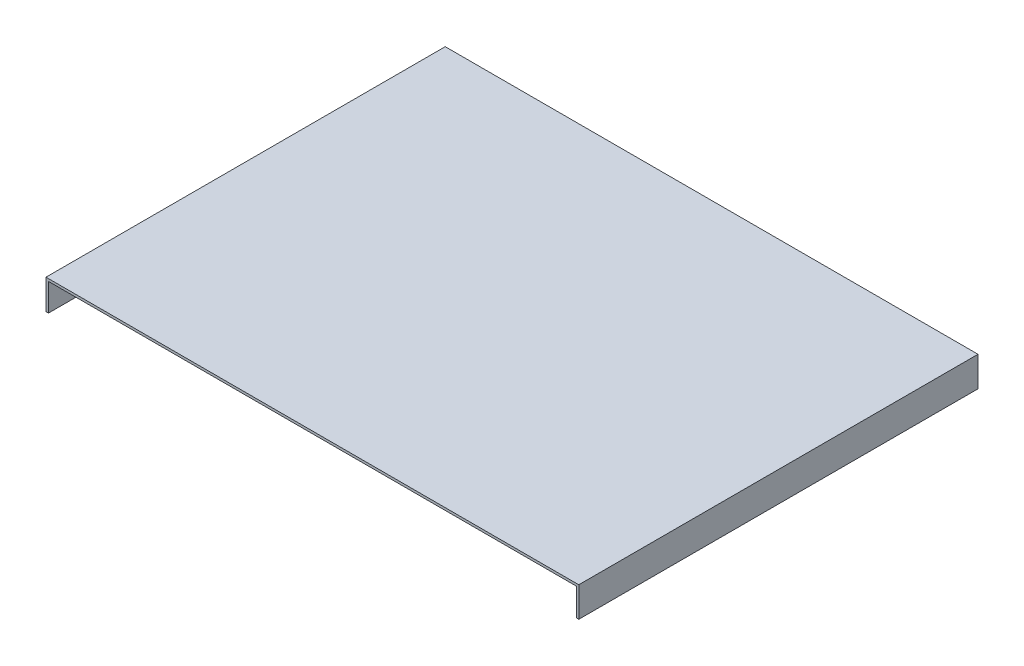
ISO-10303-21;
HEADER;
FILE_DESCRIPTION(('STEP AP214'),'2;1');
FILE_NAME('part.step','',(''),(''),'','','');
FILE_SCHEMA(('AUTOMOTIVE_DESIGN { 1 0 10303 214 1 1 1 1 }'));
ENDSEC;
DATA;
#1=APPLICATION_CONTEXT('core data for automotive mechanical design processes');
#2=APPLICATION_PROTOCOL_DEFINITION('international standard','automotive_design',2000,#1);
#3=PRODUCT_CONTEXT('',#1,'mechanical');
#4=PRODUCT('Part','Part','',(#3));
#5=PRODUCT_RELATED_PRODUCT_CATEGORY('part','',(#4));
#6=PRODUCT_DEFINITION_FORMATION('','',#4);
#7=PRODUCT_DEFINITION_CONTEXT('part definition',#1,'design');
#8=PRODUCT_DEFINITION('design','',#6,#7);
#9=PRODUCT_DEFINITION_SHAPE('','',#8);
#10=(LENGTH_UNIT() NAMED_UNIT(*) SI_UNIT(.MILLI.,.METRE.));
#11=(NAMED_UNIT(*) PLANE_ANGLE_UNIT() SI_UNIT($,.RADIAN.));
#12=(NAMED_UNIT(*) SI_UNIT($,.STERADIAN.) SOLID_ANGLE_UNIT());
#13=UNCERTAINTY_MEASURE_WITH_UNIT(LENGTH_MEASURE(1.E-05),#10,'distance_accuracy_value','');
#14=(GEOMETRIC_REPRESENTATION_CONTEXT(3) GLOBAL_UNCERTAINTY_ASSIGNED_CONTEXT((#13)) GLOBAL_UNIT_ASSIGNED_CONTEXT((#10,
#11,#12)) REPRESENTATION_CONTEXT('',''));
#15=CARTESIAN_POINT('',(0.,0.,0.));
#16=DIRECTION('',(0.,0.,1.));
#17=DIRECTION('',(1.,0.,0.));
#18=AXIS2_PLACEMENT_3D('',#15,#16,#17);
#19=CARTESIAN_POINT('',(-193.5,-1.75,290.));
#20=DIRECTION('',(0.,1.,0.));
#21=DIRECTION('',(-1.,0.,0.));
#22=AXIS2_PLACEMENT_3D('',#19,#20,#21);
#23=PLANE('',#22);
#24=DIRECTION('',(0.,0.,1.));
#25=VECTOR('',#24,1.);
#26=CARTESIAN_POINT('',(-191.75,-1.75,1.74999999999995));
#27=LINE('',#26,#25);
#28=CARTESIAN_POINT('',(-191.75,-1.75,1.74999999999995));
#29=VERTEX_POINT('',#28);
#30=CARTESIAN_POINT('',(-191.75,-1.75,290.));
#31=VERTEX_POINT('',#30);
#32=EDGE_CURVE('E49',#29,#31,#27,.T.);
#33=ORIENTED_EDGE('',*,*,#32,.F.);
#34=DIRECTION('',(-1.,0.,0.));
#35=VECTOR('',#34,1.);
#36=CARTESIAN_POINT('',(191.75,-1.75,1.75));
#37=LINE('',#36,#35);
#38=CARTESIAN_POINT('',(191.75,-1.75,1.75));
#39=VERTEX_POINT('',#38);
#40=EDGE_CURVE('E126',#39,#29,#37,.T.);
#41=ORIENTED_EDGE('',*,*,#40,.F.);
#42=DIRECTION('',(0.,0.,-1.));
#43=VECTOR('',#42,1.);
#44=CARTESIAN_POINT('',(191.75,-1.75,290.));
#45=LINE('',#44,#43);
#46=CARTESIAN_POINT('',(191.75,-1.75,290.));
#47=VERTEX_POINT('',#46);
#48=EDGE_CURVE('E54',#47,#39,#45,.T.);
#49=ORIENTED_EDGE('',*,*,#48,.F.);
#50=DIRECTION('',(1.,0.,0.));
#51=VECTOR('',#50,1.);
#52=CARTESIAN_POINT('',(-193.5,-1.75,290.));
#53=LINE('',#52,#51);
#54=EDGE_CURVE('E109',#31,#47,#53,.T.);
#55=ORIENTED_EDGE('',*,*,#54,.F.);
#56=EDGE_LOOP('',(#33,#41,#49,#55));
#57=FACE_BOUND('',#56,.T.);
#58=ADVANCED_FACE('F34',(#57),#23,.F.);
#59=CARTESIAN_POINT('',(193.5,0.,290.));
#60=DIRECTION('',(-1.,0.,0.));
#61=DIRECTION('',(0.,0.,1.));
#62=AXIS2_PLACEMENT_3D('',#59,#60,#61);
#63=PLANE('',#62);
#64=DIRECTION('',(0.,1.,0.));
#65=VECTOR('',#64,1.);
#66=CARTESIAN_POINT('',(193.5,0.,0.));
#67=LINE('',#66,#65);
#68=CARTESIAN_POINT('',(193.5,-21.75,0.));
#69=VERTEX_POINT('',#68);
#70=CARTESIAN_POINT('',(193.5,0.,0.));
#71=VERTEX_POINT('',#70);
#72=EDGE_CURVE('E153',#69,#71,#67,.T.);
#73=ORIENTED_EDGE('',*,*,#72,.T.);
#74=DIRECTION('',(0.,0.,-1.));
#75=VECTOR('',#74,1.);
#76=CARTESIAN_POINT('',(193.5,0.,290.));
#77=LINE('',#76,#75);
#78=CARTESIAN_POINT('',(193.5,0.,290.));
#79=VERTEX_POINT('',#78);
#80=EDGE_CURVE('E11',#79,#71,#77,.T.);
#81=ORIENTED_EDGE('',*,*,#80,.F.);
#82=DIRECTION('',(0.,1.,0.));
#83=VECTOR('',#82,1.);
#84=CARTESIAN_POINT('',(193.5,0.,290.));
#85=LINE('',#84,#83);
#86=CARTESIAN_POINT('',(193.5,-21.75,290.));
#87=VERTEX_POINT('',#86);
#88=EDGE_CURVE('E154',#87,#79,#85,.T.);
#89=ORIENTED_EDGE('',*,*,#88,.F.);
#90=DIRECTION('',(0.,0.,1.));
#91=VECTOR('',#90,1.);
#92=CARTESIAN_POINT('',(193.5,-21.75,0.));
#93=LINE('',#92,#91);
#94=EDGE_CURVE('E130',#69,#87,#93,.T.);
#95=ORIENTED_EDGE('',*,*,#94,.F.);
#96=EDGE_LOOP('',(#73,#81,#89,#95));
#97=FACE_BOUND('',#96,.T.);
#98=ADVANCED_FACE('F36',(#97),#63,.F.);
#99=CARTESIAN_POINT('',(-193.5,0.,290.));
#100=DIRECTION('',(0.,-1.,0.));
#101=DIRECTION('',(1.,0.,0.));
#102=AXIS2_PLACEMENT_3D('',#99,#100,#101);
#103=PLANE('',#102);
#104=DIRECTION('',(-1.,0.,0.));
#105=VECTOR('',#104,1.);
#106=CARTESIAN_POINT('',(-193.5,0.,0.));
#107=LINE('',#106,#105);
#108=CARTESIAN_POINT('',(-193.5,0.,0.));
#109=VERTEX_POINT('',#108);
#110=EDGE_CURVE('E160',#71,#109,#107,.T.);
#111=ORIENTED_EDGE('',*,*,#110,.T.);
#112=DIRECTION('',(0.,0.,-1.));
#113=VECTOR('',#112,1.);
#114=CARTESIAN_POINT('',(-193.5,0.,290.));
#115=LINE('',#114,#113);
#116=CARTESIAN_POINT('',(-193.5,0.,290.));
#117=VERTEX_POINT('',#116);
#118=EDGE_CURVE('E42',#117,#109,#115,.T.);
#119=ORIENTED_EDGE('',*,*,#118,.F.);
#120=DIRECTION('',(-1.,0.,0.));
#121=VECTOR('',#120,1.);
#122=CARTESIAN_POINT('',(-193.5,0.,290.));
#123=LINE('',#122,#121);
#124=EDGE_CURVE('E105',#79,#117,#123,.T.);
#125=ORIENTED_EDGE('',*,*,#124,.F.);
#126=ORIENTED_EDGE('',*,*,#80,.T.);
#127=EDGE_LOOP('',(#111,#119,#125,#126));
#128=FACE_BOUND('',#127,.T.);
#129=ADVANCED_FACE('F185',(#128),#103,.F.);
#130=CARTESIAN_POINT('',(-193.5,0.,290.));
#131=DIRECTION('',(1.,0.,0.));
#132=DIRECTION('',(0.,0.,-1.));
#133=AXIS2_PLACEMENT_3D('',#130,#131,#132);
#134=PLANE('',#133);
#135=DIRECTION('',(0.,-1.,0.));
#136=VECTOR('',#135,1.);
#137=CARTESIAN_POINT('',(-193.5,0.,0.));
#138=LINE('',#137,#136);
#139=CARTESIAN_POINT('',(-193.5,-21.75,0.));
#140=VERTEX_POINT('',#139);
#141=EDGE_CURVE('E115',#109,#140,#138,.T.);
#142=ORIENTED_EDGE('',*,*,#141,.T.);
#143=DIRECTION('',(0.,0.,-1.));
#144=VECTOR('',#143,1.);
#145=CARTESIAN_POINT('',(-193.5,-21.75,290.));
#146=LINE('',#145,#144);
#147=CARTESIAN_POINT('',(-193.5,-21.75,290.));
#148=VERTEX_POINT('',#147);
#149=EDGE_CURVE('E112',#148,#140,#146,.T.);
#150=ORIENTED_EDGE('',*,*,#149,.F.);
#151=DIRECTION('',(0.,-1.,0.));
#152=VECTOR('',#151,1.);
#153=CARTESIAN_POINT('',(-193.5,0.,290.));
#154=LINE('',#153,#152);
#155=EDGE_CURVE('E98',#117,#148,#154,.T.);
#156=ORIENTED_EDGE('',*,*,#155,.F.);
#157=ORIENTED_EDGE('',*,*,#118,.T.);
#158=EDGE_LOOP('',(#142,#150,#156,#157));
#159=FACE_BOUND('',#158,.T.);
#160=ADVANCED_FACE('F113',(#159),#134,.F.);
#161=CARTESIAN_POINT('',(0.,0.,290.));
#162=DIRECTION('',(0.,0.,1.));
#163=DIRECTION('',(1.,0.,0.));
#164=AXIS2_PLACEMENT_3D('',#161,#162,#163);
#165=PLANE('',#164);
#166=ORIENTED_EDGE('',*,*,#88,.T.);
#167=ORIENTED_EDGE('',*,*,#124,.T.);
#168=ORIENTED_EDGE('',*,*,#155,.T.);
#169=DIRECTION('',(-1.,0.,0.));
#170=VECTOR('',#169,1.);
#171=CARTESIAN_POINT('',(-191.75,-21.75,290.));
#172=LINE('',#171,#170);
#173=CARTESIAN_POINT('',(-191.75,-21.75,290.));
#174=VERTEX_POINT('',#173);
#175=EDGE_CURVE('E104',#174,#148,#172,.T.);
#176=ORIENTED_EDGE('',*,*,#175,.F.);
#177=DIRECTION('',(0.,1.,0.));
#178=VECTOR('',#177,1.);
#179=CARTESIAN_POINT('',(-191.75,-21.75,290.));
#180=LINE('',#179,#178);
#181=EDGE_CURVE('E140',#174,#31,#180,.T.);
#182=ORIENTED_EDGE('',*,*,#181,.T.);
#183=ORIENTED_EDGE('',*,*,#54,.T.);
#184=DIRECTION('',(0.,1.,0.));
#185=VECTOR('',#184,1.);
#186=CARTESIAN_POINT('',(191.75,-21.75,290.));
#187=LINE('',#186,#185);
#188=CARTESIAN_POINT('',(191.75,-21.75,290.));
#189=VERTEX_POINT('',#188);
#190=EDGE_CURVE('E150',#189,#47,#187,.T.);
#191=ORIENTED_EDGE('',*,*,#190,.F.);
#192=DIRECTION('',(-1.,0.,0.));
#193=VECTOR('',#192,1.);
#194=CARTESIAN_POINT('',(193.5,-21.75,290.));
#195=LINE('',#194,#193);
#196=EDGE_CURVE('E133',#87,#189,#195,.T.);
#197=ORIENTED_EDGE('',*,*,#196,.F.);
#198=EDGE_LOOP('',(#166,#167,#168,#176,#182,#183,#191,#197));
#199=FACE_BOUND('',#198,.T.);
#200=ADVANCED_FACE('F101',(#199),#165,.T.);
#201=CARTESIAN_POINT('',(0.,0.,0.));
#202=DIRECTION('',(0.,0.,1.));
#203=DIRECTION('',(1.,0.,0.));
#204=AXIS2_PLACEMENT_3D('',#201,#202,#203);
#205=PLANE('',#204);
#206=ORIENTED_EDGE('',*,*,#72,.F.);
#207=DIRECTION('',(1.,0.,0.));
#208=VECTOR('',#207,1.);
#209=CARTESIAN_POINT('',(-193.5,-21.75,0.));
#210=LINE('',#209,#208);
#211=EDGE_CURVE('E119',#140,#69,#210,.T.);
#212=ORIENTED_EDGE('',*,*,#211,.F.);
#213=ORIENTED_EDGE('',*,*,#141,.F.);
#214=ORIENTED_EDGE('',*,*,#110,.F.);
#215=EDGE_LOOP('',(#206,#212,#213,#214));
#216=FACE_BOUND('',#215,.T.);
#217=ADVANCED_FACE('F164',(#216),#205,.F.);
#218=CARTESIAN_POINT('',(191.75,-21.75,290.));
#219=DIRECTION('',(1.,0.,0.));
#220=DIRECTION('',(0.,0.,-1.));
#221=AXIS2_PLACEMENT_3D('',#218,#219,#220);
#222=PLANE('',#221);
#223=ORIENTED_EDGE('',*,*,#48,.T.);
#224=DIRECTION('',(0.,1.,0.));
#225=VECTOR('',#224,1.);
#226=CARTESIAN_POINT('',(191.75,-21.75,1.75));
#227=LINE('',#226,#225);
#228=CARTESIAN_POINT('',(191.75,-21.75,1.75));
#229=VERTEX_POINT('',#228);
#230=EDGE_CURVE('E147',#229,#39,#227,.T.);
#231=ORIENTED_EDGE('',*,*,#230,.F.);
#232=DIRECTION('',(0.,0.,-1.));
#233=VECTOR('',#232,1.);
#234=CARTESIAN_POINT('',(191.75,-21.75,290.));
#235=LINE('',#234,#233);
#236=EDGE_CURVE('E135',#189,#229,#235,.T.);
#237=ORIENTED_EDGE('',*,*,#236,.F.);
#238=ORIENTED_EDGE('',*,*,#190,.T.);
#239=EDGE_LOOP('',(#223,#231,#237,#238));
#240=FACE_BOUND('',#239,.T.);
#241=ADVANCED_FACE('F175',(#240),#222,.F.);
#242=CARTESIAN_POINT('',(191.75,-21.75,1.75));
#243=DIRECTION('',(0.,0.,-1.));
#244=DIRECTION('',(-1.,0.,0.));
#245=AXIS2_PLACEMENT_3D('',#242,#243,#244);
#246=PLANE('',#245);
#247=ORIENTED_EDGE('',*,*,#40,.T.);
#248=DIRECTION('',(0.,1.,0.));
#249=VECTOR('',#248,1.);
#250=CARTESIAN_POINT('',(-191.75,-21.75,1.74999999999995));
#251=LINE('',#250,#249);
#252=CARTESIAN_POINT('',(-191.75,-21.75,1.74999999999995));
#253=VERTEX_POINT('',#252);
#254=EDGE_CURVE('E144',#253,#29,#251,.T.);
#255=ORIENTED_EDGE('',*,*,#254,.F.);
#256=DIRECTION('',(-1.,0.,0.));
#257=VECTOR('',#256,1.);
#258=CARTESIAN_POINT('',(191.75,-21.75,1.75));
#259=LINE('',#258,#257);
#260=EDGE_CURVE('E137',#229,#253,#259,.T.);
#261=ORIENTED_EDGE('',*,*,#260,.F.);
#262=ORIENTED_EDGE('',*,*,#230,.T.);
#263=EDGE_LOOP('',(#247,#255,#261,#262));
#264=FACE_BOUND('',#263,.T.);
#265=ADVANCED_FACE('F177',(#264),#246,.F.);
#266=CARTESIAN_POINT('',(-191.75,-21.75,1.74999999999995));
#267=DIRECTION('',(-1.,0.,0.));
#268=DIRECTION('',(0.,0.,1.));
#269=AXIS2_PLACEMENT_3D('',#266,#267,#268);
#270=PLANE('',#269);
#271=ORIENTED_EDGE('',*,*,#32,.T.);
#272=ORIENTED_EDGE('',*,*,#181,.F.);
#273=DIRECTION('',(0.,0.,1.));
#274=VECTOR('',#273,1.);
#275=CARTESIAN_POINT('',(-191.75,-21.75,1.74999999999995));
#276=LINE('',#275,#274);
#277=EDGE_CURVE('E123',#253,#174,#276,.T.);
#278=ORIENTED_EDGE('',*,*,#277,.F.);
#279=ORIENTED_EDGE('',*,*,#254,.T.);
#280=EDGE_LOOP('',(#271,#272,#278,#279));
#281=FACE_BOUND('',#280,.T.);
#282=ADVANCED_FACE('F179',(#281),#270,.F.);
#283=CARTESIAN_POINT('',(0.,-21.75,0.));
#284=DIRECTION('',(0.,-1.,0.));
#285=DIRECTION('',(0.,0.,-1.));
#286=AXIS2_PLACEMENT_3D('',#283,#284,#285);
#287=PLANE('',#286);
#288=ORIENTED_EDGE('',*,*,#175,.T.);
#289=ORIENTED_EDGE('',*,*,#149,.T.);
#290=ORIENTED_EDGE('',*,*,#211,.T.);
#291=ORIENTED_EDGE('',*,*,#94,.T.);
#292=ORIENTED_EDGE('',*,*,#196,.T.);
#293=ORIENTED_EDGE('',*,*,#236,.T.);
#294=ORIENTED_EDGE('',*,*,#260,.T.);
#295=ORIENTED_EDGE('',*,*,#277,.T.);
#296=EDGE_LOOP('',(#288,#289,#290,#291,#292,#293,#294,#295));
#297=FACE_BOUND('',#296,.T.);
#298=ADVANCED_FACE('F121',(#297),#287,.T.);
#299=CLOSED_SHELL('',(#58,#98,#129,#160,#200,#217,#241,#265,#282,#298));
#300=MANIFOLD_SOLID_BREP('B2',#299);
#301=ADVANCED_BREP_SHAPE_REPRESENTATION('',(#18,#300),#14);
#302=SHAPE_DEFINITION_REPRESENTATION(#9,#301);
ENDSEC;
END-ISO-10303-21;
